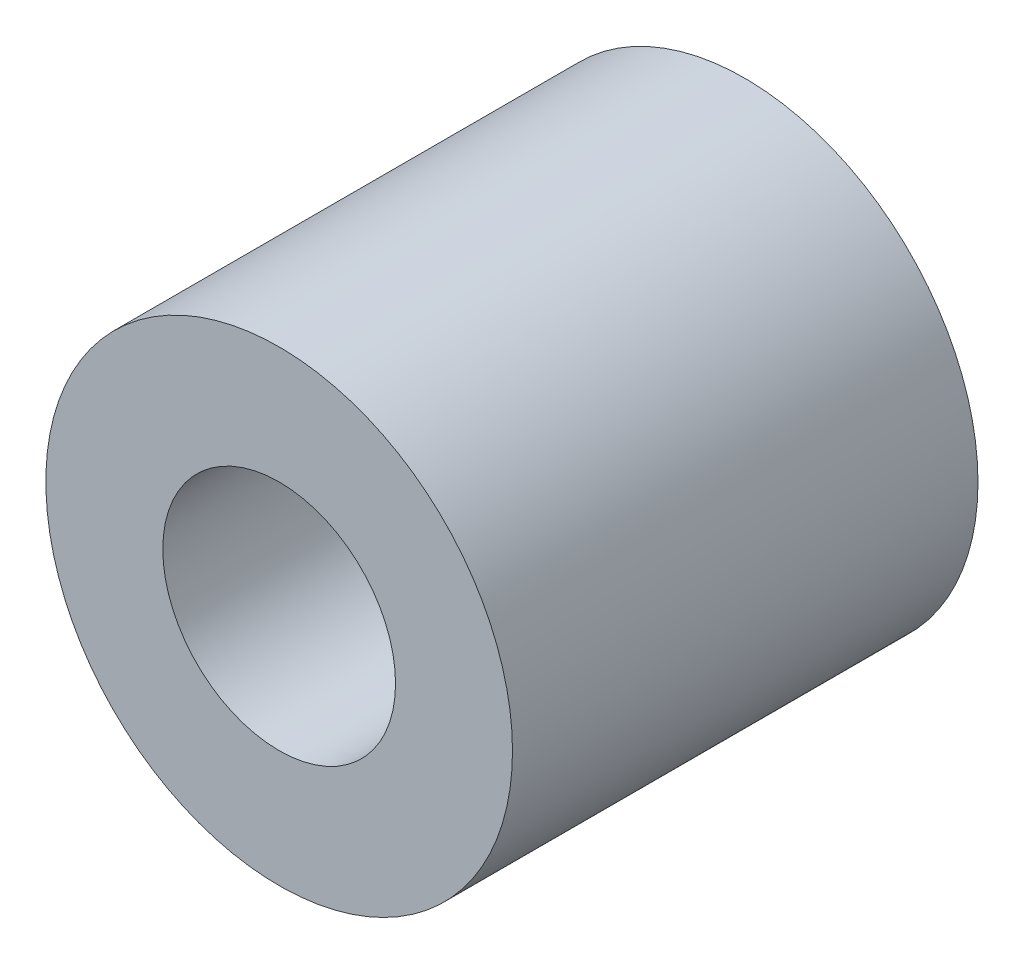
ISO-10303-21;
HEADER;
FILE_DESCRIPTION(('STEP AP214'),'2;1');
FILE_NAME('part.step','',(''),(''),'','','');
FILE_SCHEMA(('AUTOMOTIVE_DESIGN { 1 0 10303 214 1 1 1 1 }'));
ENDSEC;
DATA;
#1=APPLICATION_CONTEXT('core data for automotive mechanical design processes');
#2=APPLICATION_PROTOCOL_DEFINITION('international standard','automotive_design',2000,#1);
#3=PRODUCT_CONTEXT('',#1,'mechanical');
#4=PRODUCT('Part','Part','',(#3));
#5=PRODUCT_RELATED_PRODUCT_CATEGORY('part','',(#4));
#6=PRODUCT_DEFINITION_FORMATION('','',#4);
#7=PRODUCT_DEFINITION_CONTEXT('part definition',#1,'design');
#8=PRODUCT_DEFINITION('design','',#6,#7);
#9=PRODUCT_DEFINITION_SHAPE('','',#8);
#10=(LENGTH_UNIT() NAMED_UNIT(*) SI_UNIT(.MILLI.,.METRE.));
#11=(NAMED_UNIT(*) PLANE_ANGLE_UNIT() SI_UNIT($,.RADIAN.));
#12=(NAMED_UNIT(*) SI_UNIT($,.STERADIAN.) SOLID_ANGLE_UNIT());
#13=UNCERTAINTY_MEASURE_WITH_UNIT(LENGTH_MEASURE(1.E-05),#10,'distance_accuracy_value','');
#14=(GEOMETRIC_REPRESENTATION_CONTEXT(3) GLOBAL_UNCERTAINTY_ASSIGNED_CONTEXT((#13)) GLOBAL_UNIT_ASSIGNED_CONTEXT((#10,
#11,#12)) REPRESENTATION_CONTEXT('',''));
#15=CARTESIAN_POINT('',(0.,0.,0.));
#16=DIRECTION('',(0.,0.,1.));
#17=DIRECTION('',(1.,0.,0.));
#18=AXIS2_PLACEMENT_3D('',#15,#16,#17);
#19=CARTESIAN_POINT('',(0.,0.,4.));
#20=DIRECTION('',(0.,0.,1.));
#21=DIRECTION('',(1.,0.,0.));
#22=AXIS2_PLACEMENT_3D('',#19,#20,#21);
#23=PLANE('',#22);
#24=CARTESIAN_POINT('',(0.,0.,4.));
#25=DIRECTION('',(0.,0.,1.));
#26=DIRECTION('',(1.,0.,0.));
#27=AXIS2_PLACEMENT_3D('',#24,#25,#26);
#28=CIRCLE('',#27,4.01);
#29=CARTESIAN_POINT('',(4.01,0.,4.));
#30=VERTEX_POINT('',#29);
#31=EDGE_CURVE('E10',#30,#30,#28,.T.);
#32=ORIENTED_EDGE('',*,*,#31,.T.);
#33=EDGE_LOOP('',(#32));
#34=FACE_BOUND('',#33,.T.);
#35=CARTESIAN_POINT('',(0.,0.,4.));
#36=DIRECTION('',(0.,0.,1.));
#37=DIRECTION('',(1.,0.,0.));
#38=AXIS2_PLACEMENT_3D('',#35,#36,#37);
#39=CIRCLE('',#38,2.);
#40=CARTESIAN_POINT('',(2.,0.,4.));
#41=VERTEX_POINT('',#40);
#42=EDGE_CURVE('E41',#41,#41,#39,.T.);
#43=ORIENTED_EDGE('',*,*,#42,.F.);
#44=EDGE_LOOP('',(#43));
#45=FACE_BOUND('',#44,.T.);
#46=ADVANCED_FACE('F30',(#34,#45),#23,.T.);
#47=CARTESIAN_POINT('',(0.,0.,-4.));
#48=DIRECTION('',(0.,0.,1.));
#49=DIRECTION('',(1.,0.,0.));
#50=AXIS2_PLACEMENT_3D('',#47,#48,#49);
#51=PLANE('',#50);
#52=CARTESIAN_POINT('',(0.,0.,-4.));
#53=DIRECTION('',(0.,0.,1.));
#54=DIRECTION('',(1.,0.,0.));
#55=AXIS2_PLACEMENT_3D('',#52,#53,#54);
#56=CIRCLE('',#55,4.01);
#57=CARTESIAN_POINT('',(4.01,0.,-4.));
#58=VERTEX_POINT('',#57);
#59=EDGE_CURVE('E34',#58,#58,#56,.T.);
#60=ORIENTED_EDGE('',*,*,#59,.F.);
#61=EDGE_LOOP('',(#60));
#62=FACE_BOUND('',#61,.T.);
#63=CARTESIAN_POINT('',(0.,0.,-4.));
#64=DIRECTION('',(0.,0.,1.));
#65=DIRECTION('',(1.,0.,0.));
#66=AXIS2_PLACEMENT_3D('',#63,#64,#65);
#67=CIRCLE('',#66,2.);
#68=CARTESIAN_POINT('',(2.,0.,-4.));
#69=VERTEX_POINT('',#68);
#70=EDGE_CURVE('E43',#69,#69,#67,.T.);
#71=ORIENTED_EDGE('',*,*,#70,.T.);
#72=EDGE_LOOP('',(#71));
#73=FACE_BOUND('',#72,.T.);
#74=ADVANCED_FACE('F53',(#62,#73),#51,.F.);
#75=CARTESIAN_POINT('',(0.,0.,4.));
#76=DIRECTION('',(0.,0.,-1.));
#77=DIRECTION('',(-1.,0.,0.));
#78=AXIS2_PLACEMENT_3D('',#75,#76,#77);
#79=CYLINDRICAL_SURFACE('',#78,4.01);
#80=ORIENTED_EDGE('',*,*,#31,.F.);
#81=EDGE_LOOP('',(#80));
#82=FACE_BOUND('',#81,.T.);
#83=ORIENTED_EDGE('',*,*,#59,.T.);
#84=EDGE_LOOP('',(#83));
#85=FACE_BOUND('',#84,.T.);
#86=ADVANCED_FACE('F32',(#82,#85),#79,.T.);
#87=CARTESIAN_POINT('',(0.,0.,4.));
#88=DIRECTION('',(0.,0.,-1.));
#89=DIRECTION('',(-1.,0.,0.));
#90=AXIS2_PLACEMENT_3D('',#87,#88,#89);
#91=CYLINDRICAL_SURFACE('',#90,2.);
#92=ORIENTED_EDGE('',*,*,#42,.T.);
#93=EDGE_LOOP('',(#92));
#94=FACE_BOUND('',#93,.T.);
#95=ORIENTED_EDGE('',*,*,#70,.F.);
#96=EDGE_LOOP('',(#95));
#97=FACE_BOUND('',#96,.T.);
#98=ADVANCED_FACE('F49',(#94,#97),#91,.F.);
#99=CLOSED_SHELL('',(#46,#74,#86,#98));
#100=MANIFOLD_SOLID_BREP('B2',#99);
#101=ADVANCED_BREP_SHAPE_REPRESENTATION('',(#18,#100),#14);
#102=SHAPE_DEFINITION_REPRESENTATION(#9,#101);
ENDSEC;
END-ISO-10303-21;
